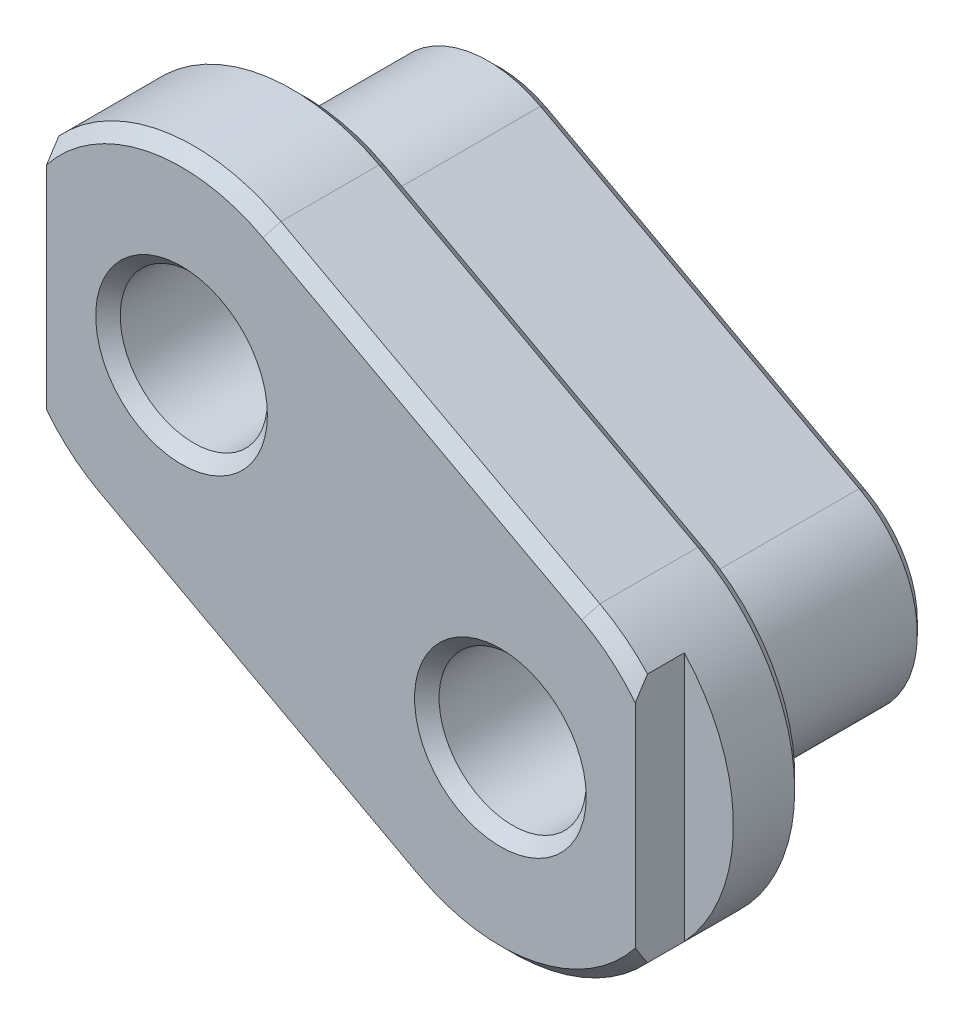
ISO-10303-21;
HEADER;
FILE_DESCRIPTION(('STEP AP214'),'2;1');
FILE_NAME('part.step','',(''),(''),'','','');
FILE_SCHEMA(('AUTOMOTIVE_DESIGN { 1 0 10303 214 1 1 1 1 }'));
ENDSEC;
DATA;
#1=APPLICATION_CONTEXT('core data for automotive mechanical design processes');
#2=APPLICATION_PROTOCOL_DEFINITION('international standard','automotive_design',2000,#1);
#3=PRODUCT_CONTEXT('',#1,'mechanical');
#4=PRODUCT('Part','Part','',(#3));
#5=PRODUCT_RELATED_PRODUCT_CATEGORY('part','',(#4));
#6=PRODUCT_DEFINITION_FORMATION('','',#4);
#7=PRODUCT_DEFINITION_CONTEXT('part definition',#1,'design');
#8=PRODUCT_DEFINITION('design','',#6,#7);
#9=PRODUCT_DEFINITION_SHAPE('','',#8);
#10=(LENGTH_UNIT() NAMED_UNIT(*) SI_UNIT(.MILLI.,.METRE.));
#11=(NAMED_UNIT(*) PLANE_ANGLE_UNIT() SI_UNIT($,.RADIAN.));
#12=(NAMED_UNIT(*) SI_UNIT($,.STERADIAN.) SOLID_ANGLE_UNIT());
#13=UNCERTAINTY_MEASURE_WITH_UNIT(LENGTH_MEASURE(1.E-05),#10,'distance_accuracy_value','');
#14=(GEOMETRIC_REPRESENTATION_CONTEXT(3) GLOBAL_UNCERTAINTY_ASSIGNED_CONTEXT((#13)) GLOBAL_UNIT_ASSIGNED_CONTEXT((#10,
#11,#12)) REPRESENTATION_CONTEXT('',''));
#15=CARTESIAN_POINT('',(0.,0.,0.));
#16=DIRECTION('',(0.,0.,1.));
#17=DIRECTION('',(1.,0.,0.));
#18=AXIS2_PLACEMENT_3D('',#15,#16,#17);
#19=CARTESIAN_POINT('',(0.,0.,16.));
#20=DIRECTION('',(0.,0.,-1.));
#21=DIRECTION('',(-1.,0.,0.));
#22=AXIS2_PLACEMENT_3D('',#19,#20,#21);
#23=CYLINDRICAL_SURFACE('',#22,8.99999999999999);
#24=DIRECTION('',(0.,0.,-1.));
#25=VECTOR('',#24,1.);
#26=CARTESIAN_POINT('',(-4.26689840731516,-7.92423989929957,16.));
#27=LINE('',#26,#25);
#28=CARTESIAN_POINT('',(-4.26689840731516,-7.92423989929957,16.));
#29=VERTEX_POINT('',#28);
#30=CARTESIAN_POINT('',(-4.26689840731516,-7.92423989929957,0.999999999999999));
#31=VERTEX_POINT('',#30);
#32=EDGE_CURVE('E237',#29,#31,#27,.T.);
#33=ORIENTED_EDGE('',*,*,#32,.T.);
#34=CARTESIAN_POINT('',(0.,0.,0.999999999999999));
#35=DIRECTION('',(0.,0.,1.));
#36=DIRECTION('',(1.,0.,0.));
#37=AXIS2_PLACEMENT_3D('',#34,#35,#36);
#38=CIRCLE('',#37,8.99999999999999);
#39=CARTESIAN_POINT('',(4.26689840731516,7.92423989929956,0.999999999999999));
#40=VERTEX_POINT('',#39);
#41=EDGE_CURVE('E271',#31,#40,#38,.T.);
#42=ORIENTED_EDGE('',*,*,#41,.T.);
#43=DIRECTION('',(0.,0.,-1.));
#44=VECTOR('',#43,1.);
#45=CARTESIAN_POINT('',(4.26689840731516,7.92423989929956,16.));
#46=LINE('',#45,#44);
#47=CARTESIAN_POINT('',(4.26689840731516,7.92423989929956,16.));
#48=VERTEX_POINT('',#47);
#49=EDGE_CURVE('E246',#48,#40,#46,.T.);
#50=ORIENTED_EDGE('',*,*,#49,.F.);
#51=CARTESIAN_POINT('',(0.,0.,16.));
#52=DIRECTION('',(0.,0.,1.));
#53=DIRECTION('',(1.,0.,0.));
#54=AXIS2_PLACEMENT_3D('',#51,#52,#53);
#55=CIRCLE('',#54,8.99999999999999);
#56=EDGE_CURVE('E225',#29,#48,#55,.T.);
#57=ORIENTED_EDGE('',*,*,#56,.F.);
#58=EDGE_LOOP('',(#33,#42,#50,#57));
#59=FACE_BOUND('',#58,.T.);
#60=ADVANCED_FACE('F34',(#59),#23,.T.);
#61=CARTESIAN_POINT('',(-21.7331015926848,21.9242398992996,16.));
#62=DIRECTION('',(-0.474099823035018,-0.880471099922175,0.));
#63=DIRECTION('',(0.880471099922175,-0.474099823035018,0.));
#64=AXIS2_PLACEMENT_3D('',#61,#62,#63);
#65=PLANE('',#64);
#66=ORIENTED_EDGE('',*,*,#49,.T.);
#67=DIRECTION('',(-0.880471099922175,0.474099823035018,0.));
#68=VECTOR('',#67,1.);
#69=CARTESIAN_POINT('',(-21.7331015926848,21.9242398992996,0.999999999999999));
#70=LINE('',#69,#68);
#71=CARTESIAN_POINT('',(-21.7331015926848,21.9242398992996,0.999999999999999));
#72=VERTEX_POINT('',#71);
#73=EDGE_CURVE('E249',#40,#72,#70,.T.);
#74=ORIENTED_EDGE('',*,*,#73,.T.);
#75=DIRECTION('',(0.,0.,-1.));
#76=VECTOR('',#75,1.);
#77=CARTESIAN_POINT('',(-21.7331015926848,21.9242398992996,16.));
#78=LINE('',#77,#76);
#79=CARTESIAN_POINT('',(-21.7331015926848,21.9242398992996,16.));
#80=VERTEX_POINT('',#79);
#81=EDGE_CURVE('E243',#80,#72,#78,.T.);
#82=ORIENTED_EDGE('',*,*,#81,.F.);
#83=DIRECTION('',(-0.880471099922175,0.474099823035018,0.));
#84=VECTOR('',#83,1.);
#85=CARTESIAN_POINT('',(-21.7331015926848,21.9242398992996,16.));
#86=LINE('',#85,#84);
#87=EDGE_CURVE('E228',#48,#80,#86,.T.);
#88=ORIENTED_EDGE('',*,*,#87,.F.);
#89=EDGE_LOOP('',(#66,#74,#82,#88));
#90=FACE_BOUND('',#89,.T.);
#91=ADVANCED_FACE('F398',(#90),#65,.F.);
#92=CARTESIAN_POINT('',(-26.,14.,16.));
#93=DIRECTION('',(0.,0.,-1.));
#94=DIRECTION('',(-1.,0.,0.));
#95=AXIS2_PLACEMENT_3D('',#92,#93,#94);
#96=CYLINDRICAL_SURFACE('',#95,9.);
#97=ORIENTED_EDGE('',*,*,#81,.T.);
#98=CARTESIAN_POINT('',(-26.,14.,0.999999999999999));
#99=DIRECTION('',(0.,0.,1.));
#100=DIRECTION('',(1.,0.,0.));
#101=AXIS2_PLACEMENT_3D('',#98,#99,#100);
#102=CIRCLE('',#101,9.);
#103=CARTESIAN_POINT('',(-30.2668984073152,6.07576010070043,0.999999999999999));
#104=VERTEX_POINT('',#103);
#105=EDGE_CURVE('E267',#72,#104,#102,.T.);
#106=ORIENTED_EDGE('',*,*,#105,.T.);
#107=DIRECTION('',(0.,0.,-1.));
#108=VECTOR('',#107,1.);
#109=CARTESIAN_POINT('',(-30.2668984073152,6.07576010070043,16.));
#110=LINE('',#109,#108);
#111=CARTESIAN_POINT('',(-30.2668984073152,6.07576010070043,16.));
#112=VERTEX_POINT('',#111);
#113=EDGE_CURVE('E240',#112,#104,#110,.T.);
#114=ORIENTED_EDGE('',*,*,#113,.F.);
#115=CARTESIAN_POINT('',(-26.,14.,16.));
#116=DIRECTION('',(0.,0.,1.));
#117=DIRECTION('',(1.,0.,0.));
#118=AXIS2_PLACEMENT_3D('',#115,#116,#117);
#119=CIRCLE('',#118,9.);
#120=EDGE_CURVE('E231',#80,#112,#119,.T.);
#121=ORIENTED_EDGE('',*,*,#120,.F.);
#122=EDGE_LOOP('',(#97,#106,#114,#121));
#123=FACE_BOUND('',#122,.T.);
#124=ADVANCED_FACE('F404',(#123),#96,.T.);
#125=CARTESIAN_POINT('',(-30.2668984073152,6.07576010070042,16.));
#126=DIRECTION('',(0.474099823035017,0.880471099922175,0.));
#127=DIRECTION('',(-0.880471099922175,0.474099823035018,0.));
#128=AXIS2_PLACEMENT_3D('',#125,#126,#127);
#129=PLANE('',#128);
#130=ORIENTED_EDGE('',*,*,#113,.T.);
#131=DIRECTION('',(0.880471099922175,-0.474099823035018,0.));
#132=VECTOR('',#131,1.);
#133=CARTESIAN_POINT('',(-30.2668984073152,6.07576010070042,0.999999999999999));
#134=LINE('',#133,#132);
#135=EDGE_CURVE('E269',#104,#31,#134,.T.);
#136=ORIENTED_EDGE('',*,*,#135,.T.);
#137=ORIENTED_EDGE('',*,*,#32,.F.);
#138=DIRECTION('',(0.880471099922175,-0.474099823035017,0.));
#139=VECTOR('',#138,1.);
#140=CARTESIAN_POINT('',(-30.2668984073152,6.07576010070042,16.));
#141=LINE('',#140,#139);
#142=EDGE_CURVE('E234',#112,#29,#141,.T.);
#143=ORIENTED_EDGE('',*,*,#142,.F.);
#144=EDGE_LOOP('',(#130,#136,#137,#143));
#145=FACE_BOUND('',#144,.T.);
#146=ADVANCED_FACE('F540',(#145),#129,.F.);
#147=CARTESIAN_POINT('',(0.,0.,0.));
#148=DIRECTION('',(0.,0.,1.));
#149=DIRECTION('',(1.,0.,0.));
#150=AXIS2_PLACEMENT_3D('',#147,#148,#149);
#151=PLANE('',#150);
#152=CARTESIAN_POINT('',(-26.,14.,0.));
#153=DIRECTION('',(0.,0.,1.));
#154=DIRECTION('',(1.,0.,0.));
#155=AXIS2_PLACEMENT_3D('',#152,#153,#154);
#156=CIRCLE('',#155,7.99999999999999);
#157=CARTESIAN_POINT('',(-29.7927985842801,6.95623120062261,0.));
#158=VERTEX_POINT('',#157);
#159=CARTESIAN_POINT('',(-22.2072014157199,21.0437687993774,0.));
#160=VERTEX_POINT('',#159);
#161=EDGE_CURVE('E262',#158,#160,#156,.F.);
#162=ORIENTED_EDGE('',*,*,#161,.T.);
#163=DIRECTION('',(0.880471099922175,-0.474099823035018,0.));
#164=VECTOR('',#163,1.);
#165=CARTESIAN_POINT('',(3.79279858428014,7.04376879937739,0.));
#166=LINE('',#165,#164);
#167=CARTESIAN_POINT('',(3.79279858428014,7.04376879937739,0.));
#168=VERTEX_POINT('',#167);
#169=EDGE_CURVE('E264',#160,#168,#166,.T.);
#170=ORIENTED_EDGE('',*,*,#169,.T.);
#171=CARTESIAN_POINT('',(0.,0.,0.));
#172=DIRECTION('',(0.,0.,1.));
#173=DIRECTION('',(1.,0.,0.));
#174=AXIS2_PLACEMENT_3D('',#171,#172,#173);
#175=CIRCLE('',#174,7.99999999999999);
#176=CARTESIAN_POINT('',(-3.79279858428014,-7.04376879937739,0.));
#177=VERTEX_POINT('',#176);
#178=EDGE_CURVE('E258',#168,#177,#175,.F.);
#179=ORIENTED_EDGE('',*,*,#178,.T.);
#180=DIRECTION('',(-0.880471099922175,0.474099823035018,0.));
#181=VECTOR('',#180,1.);
#182=CARTESIAN_POINT('',(-3.79279858428013,-7.04376879937739,0.));
#183=LINE('',#182,#181);
#184=EDGE_CURVE('E260',#177,#158,#183,.T.);
#185=ORIENTED_EDGE('',*,*,#184,.T.);
#186=EDGE_LOOP('',(#162,#170,#179,#185));
#187=FACE_BOUND('',#186,.T.);
#188=CARTESIAN_POINT('',(-26.,14.,0.));
#189=DIRECTION('',(0.,0.,1.));
#190=DIRECTION('',(1.,0.,0.));
#191=AXIS2_PLACEMENT_3D('',#188,#189,#190);
#192=CIRCLE('',#191,7.00000000000001);
#193=CARTESIAN_POINT('',(-19.,14.,0.));
#194=VERTEX_POINT('',#193);
#195=EDGE_CURVE('E255',#194,#194,#192,.T.);
#196=ORIENTED_EDGE('',*,*,#195,.T.);
#197=EDGE_LOOP('',(#196));
#198=FACE_BOUND('',#197,.T.);
#199=CARTESIAN_POINT('',(0.,0.,0.));
#200=DIRECTION('',(0.,0.,1.));
#201=DIRECTION('',(1.,0.,0.));
#202=AXIS2_PLACEMENT_3D('',#199,#200,#201);
#203=CIRCLE('',#202,7.00000000000001);
#204=CARTESIAN_POINT('',(7.00000000000001,0.,0.));
#205=VERTEX_POINT('',#204);
#206=EDGE_CURVE('E252',#205,#205,#203,.T.);
#207=ORIENTED_EDGE('',*,*,#206,.T.);
#208=EDGE_LOOP('',(#207));
#209=FACE_BOUND('',#208,.T.);
#210=ADVANCED_FACE('F530',(#187,#198,#209),#151,.F.);
#211=CARTESIAN_POINT('',(0.,0.,16.));
#212=DIRECTION('',(0.,0.,1.));
#213=DIRECTION('',(1.,0.,0.));
#214=AXIS2_PLACEMENT_3D('',#211,#212,#213);
#215=PLANE('',#214);
#216=DIRECTION('',(0.880471099922175,-0.474099823035018,0.));
#217=VECTOR('',#216,1.);
#218=CARTESIAN_POINT('',(6.63739752249025,12.3265953989105,16.));
#219=LINE('',#218,#217);
#220=CARTESIAN_POINT('',(-19.3626024775097,26.3265953989105,16.));
#221=VERTEX_POINT('',#220);
#222=CARTESIAN_POINT('',(6.63739752249026,12.3265953989104,16.));
#223=VERTEX_POINT('',#222);
#224=EDGE_CURVE('E296',#221,#223,#219,.T.);
#225=ORIENTED_EDGE('',*,*,#224,.T.);
#226=CARTESIAN_POINT('',(0.,0.,16.));
#227=DIRECTION('',(0.,0.,1.));
#228=DIRECTION('',(1.,0.,0.));
#229=AXIS2_PLACEMENT_3D('',#226,#227,#228);
#230=CIRCLE('',#229,14.);
#231=CARTESIAN_POINT('',(-6.63739752249026,-12.3265953989105,16.));
#232=VERTEX_POINT('',#231);
#233=EDGE_CURVE('E298',#223,#232,#230,.F.);
#234=ORIENTED_EDGE('',*,*,#233,.T.);
#235=DIRECTION('',(-0.880471099922175,0.474099823035018,0.));
#236=VECTOR('',#235,1.);
#237=CARTESIAN_POINT('',(-6.63739752249025,-12.3265953989105,16.));
#238=LINE('',#237,#236);
#239=CARTESIAN_POINT('',(-32.6373975224902,1.67340460108955,16.));
#240=VERTEX_POINT('',#239);
#241=EDGE_CURVE('E294',#232,#240,#238,.T.);
#242=ORIENTED_EDGE('',*,*,#241,.T.);
#243=CARTESIAN_POINT('',(-26.,14.,16.));
#244=DIRECTION('',(0.,0.,1.));
#245=DIRECTION('',(1.,0.,0.));
#246=AXIS2_PLACEMENT_3D('',#243,#244,#245);
#247=CIRCLE('',#246,14.);
#248=EDGE_CURVE('E292',#240,#221,#247,.F.);
#249=ORIENTED_EDGE('',*,*,#248,.T.);
#250=EDGE_LOOP('',(#225,#234,#242,#249));
#251=FACE_BOUND('',#250,.T.);
#252=ORIENTED_EDGE('',*,*,#142,.T.);
#253=ORIENTED_EDGE('',*,*,#56,.T.);
#254=ORIENTED_EDGE('',*,*,#87,.T.);
#255=ORIENTED_EDGE('',*,*,#120,.T.);
#256=EDGE_LOOP('',(#252,#253,#254,#255));
#257=FACE_BOUND('',#256,.T.);
#258=ADVANCED_FACE('F537',(#251,#257),#215,.F.);
#259=CARTESIAN_POINT('',(0.,0.,26.));
#260=DIRECTION('',(0.,0.,-1.));
#261=DIRECTION('',(-1.,0.,0.));
#262=AXIS2_PLACEMENT_3D('',#259,#260,#261);
#263=CYLINDRICAL_SURFACE('',#262,15.);
#264=DIRECTION('',(0.,0.,-1.));
#265=VECTOR('',#264,1.);
#266=CARTESIAN_POINT('',(-7.11149734552527,-13.2070664988326,26.));
#267=LINE('',#266,#265);
#268=CARTESIAN_POINT('',(-7.11149734552527,-13.2070664988326,25.));
#269=VERTEX_POINT('',#268);
#270=CARTESIAN_POINT('',(-7.11149734552527,-13.2070664988326,17.));
#271=VERTEX_POINT('',#270);
#272=EDGE_CURVE('E196',#269,#271,#267,.T.);
#273=ORIENTED_EDGE('',*,*,#272,.T.);
#274=CARTESIAN_POINT('',(0.,0.,17.));
#275=DIRECTION('',(0.,0.,1.));
#276=DIRECTION('',(1.,0.,0.));
#277=AXIS2_PLACEMENT_3D('',#274,#275,#276);
#278=CIRCLE('',#277,15.);
#279=CARTESIAN_POINT('',(7.11149734552527,13.2070664988326,17.));
#280=VERTEX_POINT('',#279);
#281=EDGE_CURVE('E289',#271,#280,#278,.T.);
#282=ORIENTED_EDGE('',*,*,#281,.T.);
#283=DIRECTION('',(0.,0.,-1.));
#284=VECTOR('',#283,1.);
#285=CARTESIAN_POINT('',(7.11149734552527,13.2070664988326,26.));
#286=LINE('',#285,#284);
#287=CARTESIAN_POINT('',(7.11149734552527,13.2070664988326,25.));
#288=VERTEX_POINT('',#287);
#289=EDGE_CURVE('E222',#288,#280,#286,.T.);
#290=ORIENTED_EDGE('',*,*,#289,.F.);
#291=CARTESIAN_POINT('',(0.,0.,25.));
#292=DIRECTION('',(0.,0.,1.));
#293=DIRECTION('',(1.,0.,0.));
#294=AXIS2_PLACEMENT_3D('',#291,#292,#293);
#295=CIRCLE('',#294,15.);
#296=CARTESIAN_POINT('',(11.,10.1980390271856,25.));
#297=VERTEX_POINT('',#296);
#298=EDGE_CURVE('E285',#288,#297,#295,.F.);
#299=ORIENTED_EDGE('',*,*,#298,.T.);
#300=DIRECTION('',(0.,0.,1.));
#301=VECTOR('',#300,1.);
#302=CARTESIAN_POINT('',(11.,10.1980390271856,22.));
#303=LINE('',#302,#301);
#304=CARTESIAN_POINT('',(11.,10.1980390271856,22.));
#305=VERTEX_POINT('',#304);
#306=EDGE_CURVE('E206',#305,#297,#303,.T.);
#307=ORIENTED_EDGE('',*,*,#306,.F.);
#308=CARTESIAN_POINT('',(0.,0.,22.));
#309=DIRECTION('',(0.,0.,1.));
#310=DIRECTION('',(1.,0.,0.));
#311=AXIS2_PLACEMENT_3D('',#308,#309,#310);
#312=CIRCLE('',#311,15.);
#313=CARTESIAN_POINT('',(11.,-10.1980390271856,22.));
#314=VERTEX_POINT('',#313);
#315=EDGE_CURVE('E200',#314,#305,#312,.T.);
#316=ORIENTED_EDGE('',*,*,#315,.F.);
#317=DIRECTION('',(0.,0.,1.));
#318=VECTOR('',#317,1.);
#319=CARTESIAN_POINT('',(11.,-10.1980390271856,22.));
#320=LINE('',#319,#318);
#321=CARTESIAN_POINT('',(11.,-10.1980390271856,25.));
#322=VERTEX_POINT('',#321);
#323=EDGE_CURVE('E210',#314,#322,#320,.T.);
#324=ORIENTED_EDGE('',*,*,#323,.T.);
#325=CARTESIAN_POINT('',(0.,0.,25.));
#326=DIRECTION('',(0.,0.,1.));
#327=DIRECTION('',(1.,0.,0.));
#328=AXIS2_PLACEMENT_3D('',#325,#326,#327);
#329=CIRCLE('',#328,15.);
#330=EDGE_CURVE('E287',#322,#269,#329,.F.);
#331=ORIENTED_EDGE('',*,*,#330,.T.);
#332=EDGE_LOOP('',(#273,#282,#290,#299,#307,#316,#324,#331));
#333=FACE_BOUND('',#332,.T.);
#334=ADVANCED_FACE('F493',(#333),#263,.T.);
#335=CARTESIAN_POINT('',(7.11149734552527,13.2070664988326,26.));
#336=DIRECTION('',(-0.474099823035018,-0.880471099922175,0.));
#337=DIRECTION('',(0.880471099922175,-0.474099823035018,0.));
#338=AXIS2_PLACEMENT_3D('',#335,#336,#337);
#339=PLANE('',#338);
#340=ORIENTED_EDGE('',*,*,#289,.T.);
#341=DIRECTION('',(-0.880471099922175,0.474099823035018,0.));
#342=VECTOR('',#341,1.);
#343=CARTESIAN_POINT('',(7.11149734552527,13.2070664988326,17.));
#344=LINE('',#343,#342);
#345=CARTESIAN_POINT('',(-18.8885026544747,27.2070664988326,17.));
#346=VERTEX_POINT('',#345);
#347=EDGE_CURVE('E303',#280,#346,#344,.T.);
#348=ORIENTED_EDGE('',*,*,#347,.T.);
#349=DIRECTION('',(0.,0.,-1.));
#350=VECTOR('',#349,1.);
#351=CARTESIAN_POINT('',(-18.8885026544747,27.2070664988326,26.));
#352=LINE('',#351,#350);
#353=CARTESIAN_POINT('',(-18.8885026544747,27.2070664988326,25.));
#354=VERTEX_POINT('',#353);
#355=EDGE_CURVE('E220',#354,#346,#352,.T.);
#356=ORIENTED_EDGE('',*,*,#355,.F.);
#357=DIRECTION('',(0.880471099922175,-0.474099823035018,0.));
#358=VECTOR('',#357,1.);
#359=CARTESIAN_POINT('',(7.11149734552528,13.2070664988326,25.));
#360=LINE('',#359,#358);
#361=EDGE_CURVE('E301',#354,#288,#360,.T.);
#362=ORIENTED_EDGE('',*,*,#361,.T.);
#363=EDGE_LOOP('',(#340,#348,#356,#362));
#364=FACE_BOUND('',#363,.T.);
#365=ADVANCED_FACE('F482',(#364),#339,.F.);
#366=CARTESIAN_POINT('',(-26.,14.,26.));
#367=DIRECTION('',(0.,0.,-1.));
#368=DIRECTION('',(-1.,0.,0.));
#369=AXIS2_PLACEMENT_3D('',#366,#367,#368);
#370=CYLINDRICAL_SURFACE('',#369,15.);
#371=ORIENTED_EDGE('',*,*,#355,.T.);
#372=CARTESIAN_POINT('',(-26.,14.,17.));
#373=DIRECTION('',(0.,0.,1.));
#374=DIRECTION('',(1.,0.,0.));
#375=AXIS2_PLACEMENT_3D('',#372,#373,#374);
#376=CIRCLE('',#375,15.);
#377=CARTESIAN_POINT('',(-33.1114973455253,0.792933501167378,17.));
#378=VERTEX_POINT('',#377);
#379=EDGE_CURVE('E312',#346,#378,#376,.T.);
#380=ORIENTED_EDGE('',*,*,#379,.T.);
#381=DIRECTION('',(0.,0.,-1.));
#382=VECTOR('',#381,1.);
#383=CARTESIAN_POINT('',(-33.1114973455253,0.792933501167378,26.));
#384=LINE('',#383,#382);
#385=CARTESIAN_POINT('',(-33.1114973455253,0.792933501167378,25.));
#386=VERTEX_POINT('',#385);
#387=EDGE_CURVE('E217',#386,#378,#384,.T.);
#388=ORIENTED_EDGE('',*,*,#387,.F.);
#389=CARTESIAN_POINT('',(-26.,14.,25.));
#390=DIRECTION('',(0.,0.,1.));
#391=DIRECTION('',(1.,0.,0.));
#392=AXIS2_PLACEMENT_3D('',#389,#390,#391);
#393=CIRCLE('',#392,15.);
#394=CARTESIAN_POINT('',(-37.,3.80196097281443,25.));
#395=VERTEX_POINT('',#394);
#396=EDGE_CURVE('E194',#386,#395,#393,.F.);
#397=ORIENTED_EDGE('',*,*,#396,.T.);
#398=DIRECTION('',(0.,0.,1.));
#399=VECTOR('',#398,1.);
#400=CARTESIAN_POINT('',(-37.,3.80196097281443,22.));
#401=LINE('',#400,#399);
#402=CARTESIAN_POINT('',(-37.,3.80196097281443,22.));
#403=VERTEX_POINT('',#402);
#404=EDGE_CURVE('E187',#403,#395,#401,.T.);
#405=ORIENTED_EDGE('',*,*,#404,.F.);
#406=CARTESIAN_POINT('',(-26.,14.,22.));
#407=DIRECTION('',(0.,0.,1.));
#408=DIRECTION('',(1.,0.,0.));
#409=AXIS2_PLACEMENT_3D('',#406,#407,#408);
#410=CIRCLE('',#409,15.);
#411=CARTESIAN_POINT('',(-37.,24.1980390271856,22.));
#412=VERTEX_POINT('',#411);
#413=EDGE_CURVE('E175',#412,#403,#410,.T.);
#414=ORIENTED_EDGE('',*,*,#413,.F.);
#415=DIRECTION('',(0.,0.,1.));
#416=VECTOR('',#415,1.);
#417=CARTESIAN_POINT('',(-37.,24.1980390271856,22.));
#418=LINE('',#417,#416);
#419=CARTESIAN_POINT('',(-37.,24.1980390271856,25.));
#420=VERTEX_POINT('',#419);
#421=EDGE_CURVE('E189',#412,#420,#418,.T.);
#422=ORIENTED_EDGE('',*,*,#421,.T.);
#423=CARTESIAN_POINT('',(-26.,14.,25.));
#424=DIRECTION('',(0.,0.,1.));
#425=DIRECTION('',(1.,0.,0.));
#426=AXIS2_PLACEMENT_3D('',#423,#424,#425);
#427=CIRCLE('',#426,15.);
#428=EDGE_CURVE('E309',#420,#354,#427,.F.);
#429=ORIENTED_EDGE('',*,*,#428,.T.);
#430=EDGE_LOOP('',(#371,#380,#388,#397,#405,#414,#422,#429));
#431=FACE_BOUND('',#430,.T.);
#432=ADVANCED_FACE('F192',(#431),#370,.T.);
#433=CARTESIAN_POINT('',(-33.1114973455253,0.792933501167378,26.));
#434=DIRECTION('',(0.474099823035018,0.880471099922175,0.));
#435=DIRECTION('',(-0.880471099922175,0.474099823035018,0.));
#436=AXIS2_PLACEMENT_3D('',#433,#434,#435);
#437=PLANE('',#436);
#438=ORIENTED_EDGE('',*,*,#387,.T.);
#439=DIRECTION('',(0.880471099922175,-0.474099823035018,0.));
#440=VECTOR('',#439,1.);
#441=CARTESIAN_POINT('',(-33.1114973455253,0.792933501167378,17.));
#442=LINE('',#441,#440);
#443=EDGE_CURVE('E307',#378,#271,#442,.T.);
#444=ORIENTED_EDGE('',*,*,#443,.T.);
#445=ORIENTED_EDGE('',*,*,#272,.F.);
#446=DIRECTION('',(-0.880471099922175,0.474099823035018,0.));
#447=VECTOR('',#446,1.);
#448=CARTESIAN_POINT('',(-33.1114973455253,0.792933501167377,25.));
#449=LINE('',#448,#447);
#450=EDGE_CURVE('E305',#269,#386,#449,.T.);
#451=ORIENTED_EDGE('',*,*,#450,.T.);
#452=EDGE_LOOP('',(#438,#444,#445,#451));
#453=FACE_BOUND('',#452,.T.);
#454=ADVANCED_FACE('F555',(#453),#437,.F.);
#455=CARTESIAN_POINT('',(0.,0.,26.));
#456=DIRECTION('',(0.,0.,1.));
#457=DIRECTION('',(1.,0.,0.));
#458=AXIS2_PLACEMENT_3D('',#455,#456,#457);
#459=PLANE('',#458);
#460=CARTESIAN_POINT('',(-26.,14.,26.));
#461=DIRECTION('',(0.,0.,1.));
#462=DIRECTION('',(1.,0.,0.));
#463=AXIS2_PLACEMENT_3D('',#460,#461,#462);
#464=CIRCLE('',#463,7.);
#465=CARTESIAN_POINT('',(-19.,14.,26.));
#466=VERTEX_POINT('',#465);
#467=EDGE_CURVE('E329',#466,#466,#464,.F.);
#468=ORIENTED_EDGE('',*,*,#467,.T.);
#469=EDGE_LOOP('',(#468));
#470=FACE_BOUND('',#469,.T.);
#471=CARTESIAN_POINT('',(0.,0.,26.));
#472=DIRECTION('',(0.,0.,1.));
#473=DIRECTION('',(1.,0.,0.));
#474=AXIS2_PLACEMENT_3D('',#471,#472,#473);
#475=CIRCLE('',#474,7.);
#476=CARTESIAN_POINT('',(7.,0.,26.));
#477=VERTEX_POINT('',#476);
#478=EDGE_CURVE('E326',#477,#477,#475,.F.);
#479=ORIENTED_EDGE('',*,*,#478,.T.);
#480=EDGE_LOOP('',(#479));
#481=FACE_BOUND('',#480,.T.);
#482=DIRECTION('',(0.,1.,0.));
#483=VECTOR('',#482,1.);
#484=CARTESIAN_POINT('',(-37.,24.1980390271856,26.));
#485=LINE('',#484,#483);
#486=CARTESIAN_POINT('',(-37.,5.33974596215563,26.));
#487=VERTEX_POINT('',#486);
#488=CARTESIAN_POINT('',(-37.,22.6602540378444,26.));
#489=VERTEX_POINT('',#488);
#490=EDGE_CURVE('E182',#487,#489,#485,.T.);
#491=ORIENTED_EDGE('',*,*,#490,.F.);
#492=CARTESIAN_POINT('',(-26.,14.,26.));
#493=DIRECTION('',(0.,0.,1.));
#494=DIRECTION('',(1.,0.,0.));
#495=AXIS2_PLACEMENT_3D('',#492,#493,#494);
#496=CIRCLE('',#495,14.);
#497=CARTESIAN_POINT('',(-32.6373975224902,1.67340460108956,26.));
#498=VERTEX_POINT('',#497);
#499=EDGE_CURVE('E324',#487,#498,#496,.T.);
#500=ORIENTED_EDGE('',*,*,#499,.T.);
#501=DIRECTION('',(0.880471099922175,-0.474099823035018,0.));
#502=VECTOR('',#501,1.);
#503=CARTESIAN_POINT('',(-6.63739752249025,-12.3265953989104,26.));
#504=LINE('',#503,#502);
#505=CARTESIAN_POINT('',(-6.63739752249025,-12.3265953989104,26.));
#506=VERTEX_POINT('',#505);
#507=EDGE_CURVE('E59',#498,#506,#504,.T.);
#508=ORIENTED_EDGE('',*,*,#507,.T.);
#509=CARTESIAN_POINT('',(0.,0.,26.));
#510=DIRECTION('',(0.,0.,1.));
#511=DIRECTION('',(1.,0.,0.));
#512=AXIS2_PLACEMENT_3D('',#509,#510,#511);
#513=CIRCLE('',#512,14.);
#514=CARTESIAN_POINT('',(11.,-8.66025403784437,26.));
#515=VERTEX_POINT('',#514);
#516=EDGE_CURVE('E321',#506,#515,#513,.T.);
#517=ORIENTED_EDGE('',*,*,#516,.T.);
#518=DIRECTION('',(0.,-1.,0.));
#519=VECTOR('',#518,1.);
#520=CARTESIAN_POINT('',(11.,10.1980390271856,26.));
#521=LINE('',#520,#519);
#522=CARTESIAN_POINT('',(11.,8.66025403784437,26.));
#523=VERTEX_POINT('',#522);
#524=EDGE_CURVE('E203',#523,#515,#521,.T.);
#525=ORIENTED_EDGE('',*,*,#524,.F.);
#526=CARTESIAN_POINT('',(0.,0.,26.));
#527=DIRECTION('',(0.,0.,1.));
#528=DIRECTION('',(1.,0.,0.));
#529=AXIS2_PLACEMENT_3D('',#526,#527,#528);
#530=CIRCLE('',#529,14.);
#531=CARTESIAN_POINT('',(6.63739752249025,12.3265953989104,26.));
#532=VERTEX_POINT('',#531);
#533=EDGE_CURVE('E318',#523,#532,#530,.T.);
#534=ORIENTED_EDGE('',*,*,#533,.T.);
#535=DIRECTION('',(-0.880471099922175,0.474099823035018,0.));
#536=VECTOR('',#535,1.);
#537=CARTESIAN_POINT('',(-19.3626024775098,26.3265953989104,26.));
#538=LINE('',#537,#536);
#539=CARTESIAN_POINT('',(-19.3626024775098,26.3265953989104,26.));
#540=VERTEX_POINT('',#539);
#541=EDGE_CURVE('E316',#532,#540,#538,.T.);
#542=ORIENTED_EDGE('',*,*,#541,.T.);
#543=CARTESIAN_POINT('',(-26.,14.,26.));
#544=DIRECTION('',(0.,0.,1.));
#545=DIRECTION('',(1.,0.,0.));
#546=AXIS2_PLACEMENT_3D('',#543,#544,#545);
#547=CIRCLE('',#546,14.);
#548=EDGE_CURVE('E314',#540,#489,#547,.T.);
#549=ORIENTED_EDGE('',*,*,#548,.T.);
#550=EDGE_LOOP('',(#491,#500,#508,#517,#525,#534,#542,#549));
#551=FACE_BOUND('',#550,.T.);
#552=ADVANCED_FACE('F360',(#470,#481,#551),#459,.T.);
#553=CARTESIAN_POINT('',(11.,10.1980390271856,22.));
#554=DIRECTION('',(-1.,0.,0.));
#555=DIRECTION('',(0.,-1.,0.));
#556=AXIS2_PLACEMENT_3D('',#553,#554,#555);
#557=PLANE('',#556);
#558=ORIENTED_EDGE('',*,*,#524,.T.);
#559=CARTESIAN_POINT('',(11.,-8.66025403784437,26.));
#560=CARTESIAN_POINT('',(11.,-8.79027144318521,25.9195703536757));
#561=CARTESIAN_POINT('',(11.,-8.91978924484243,25.8383361007494));
#562=CARTESIAN_POINT('',(11.,-9.17786283805276,25.6743858458112));
#563=CARTESIAN_POINT('',(11.,-9.30641873923803,25.591670016424));
#564=CARTESIAN_POINT('',(11.,-9.56263424634968,25.4248664125517));
#565=CARTESIAN_POINT('',(11.,-9.69029386318121,25.3407786548004));
#566=CARTESIAN_POINT('',(11.,-9.94478168559513,25.1713222713733));
#567=CARTESIAN_POINT('',(11.,-10.0716097932226,25.0859534985509));
#568=CARTESIAN_POINT('',(11.,-10.1980390271856,25.));
#569=B_SPLINE_CURVE_WITH_KNOTS('',3,(#559,#560,#561,#562,#563,#564,#565,#566,#567,#568),
.UNSPECIFIED.,.F.,.F.,(4,2,2,2,4),(0.,0.458646153912249,0.917239212259313,1.37582668116352,
1.83446723618275),.UNSPECIFIED.);
#570=EDGE_CURVE('E11',#515,#322,#569,.T.);
#571=ORIENTED_EDGE('',*,*,#570,.T.);
#572=ORIENTED_EDGE('',*,*,#323,.F.);
#573=DIRECTION('',(0.,-1.,0.));
#574=VECTOR('',#573,1.);
#575=CARTESIAN_POINT('',(11.,10.1980390271856,22.));
#576=LINE('',#575,#574);
#577=EDGE_CURVE('E202',#305,#314,#576,.T.);
#578=ORIENTED_EDGE('',*,*,#577,.F.);
#579=ORIENTED_EDGE('',*,*,#306,.T.);
#580=CARTESIAN_POINT('',(11.,10.1980390271856,25.));
#581=CARTESIAN_POINT('',(11.,10.0716097932226,25.0859534985509));
#582=CARTESIAN_POINT('',(11.,9.94478168559514,25.1713222713732));
#583=CARTESIAN_POINT('',(11.,9.69029386318122,25.3407786548004));
#584=CARTESIAN_POINT('',(11.,9.56263424634968,25.4248664125517));
#585=CARTESIAN_POINT('',(11.,9.30641873923803,25.591670016424));
#586=CARTESIAN_POINT('',(11.,9.17786283805276,25.6743858458112));
#587=CARTESIAN_POINT('',(11.,8.91978924484243,25.8383361007494));
#588=CARTESIAN_POINT('',(11.,8.79027144318521,25.9195703536757));
#589=CARTESIAN_POINT('',(11.,8.66025403784437,26.));
#590=B_SPLINE_CURVE_WITH_KNOTS('',3,(#580,#581,#582,#583,#584,#585,#586,#587,#588,#589),
.UNSPECIFIED.,.F.,.F.,(4,2,2,2,4),(0.,0.45864055501924,0.917228023923448,1.37582108227052,
1.83446723618277),.UNSPECIFIED.);
#591=EDGE_CURVE('E44',#297,#523,#590,.T.);
#592=ORIENTED_EDGE('',*,*,#591,.T.);
#593=EDGE_LOOP('',(#558,#571,#572,#578,#579,#592));
#594=FACE_BOUND('',#593,.T.);
#595=ADVANCED_FACE('F355',(#594),#557,.F.);
#596=CARTESIAN_POINT('',(0.,0.,22.));
#597=DIRECTION('',(0.,0.,1.));
#598=DIRECTION('',(1.,0.,0.));
#599=AXIS2_PLACEMENT_3D('',#596,#597,#598);
#600=PLANE('',#599);
#601=ORIENTED_EDGE('',*,*,#315,.T.);
#602=ORIENTED_EDGE('',*,*,#577,.T.);
#603=EDGE_LOOP('',(#601,#602));
#604=FACE_BOUND('',#603,.T.);
#605=ADVANCED_FACE('F350',(#604),#600,.T.);
#606=CARTESIAN_POINT('',(-37.,24.1980390271856,22.));
#607=DIRECTION('',(1.,0.,0.));
#608=DIRECTION('',(0.,1.,0.));
#609=AXIS2_PLACEMENT_3D('',#606,#607,#608);
#610=PLANE('',#609);
#611=ORIENTED_EDGE('',*,*,#404,.T.);
#612=CARTESIAN_POINT('',(-37.,3.80196097281443,25.));
#613=CARTESIAN_POINT('',(-37.,3.92839020677739,25.0859534985509));
#614=CARTESIAN_POINT('',(-37.,4.05521831440486,25.1713222713733));
#615=CARTESIAN_POINT('',(-37.,4.30970613681878,25.3407786548004));
#616=CARTESIAN_POINT('',(-37.,4.43736575365031,25.4248664125517));
#617=CARTESIAN_POINT('',(-37.,4.69358126076196,25.591670016424));
#618=CARTESIAN_POINT('',(-37.,4.82213716194723,25.6743858458112));
#619=CARTESIAN_POINT('',(-37.,5.08021075515756,25.8383361007494));
#620=CARTESIAN_POINT('',(-37.,5.20972855681478,25.9195703536757));
#621=CARTESIAN_POINT('',(-37.,5.33974596215562,26.));
#622=B_SPLINE_CURVE_WITH_KNOTS('',3,(#612,#613,#614,#615,#616,#617,#618,#619,#620,#621),
.UNSPECIFIED.,.F.,.F.,(4,2,2,2,4),(0.,0.458640555019231,0.917228023923435,1.3758210822705,
1.83446723618275),.UNSPECIFIED.);
#623=EDGE_CURVE('E339',#395,#487,#622,.T.);
#624=ORIENTED_EDGE('',*,*,#623,.T.);
#625=ORIENTED_EDGE('',*,*,#490,.T.);
#626=CARTESIAN_POINT('',(-37.,22.6602540378444,26.));
#627=CARTESIAN_POINT('',(-37.,22.7902714431852,25.9195703536757));
#628=CARTESIAN_POINT('',(-37.,22.9197892448424,25.8383361007494));
#629=CARTESIAN_POINT('',(-37.,23.1778628380528,25.6743858458112));
#630=CARTESIAN_POINT('',(-37.,23.3064187392381,25.591670016424));
#631=CARTESIAN_POINT('',(-37.,23.5626342463497,25.4248664125517));
#632=CARTESIAN_POINT('',(-37.,23.6902938631812,25.3407786548004));
#633=CARTESIAN_POINT('',(-37.,23.9447816855952,25.1713222713732));
#634=CARTESIAN_POINT('',(-37.,24.0716097932226,25.0859534985509));
#635=CARTESIAN_POINT('',(-37.,24.1980390271856,25.));
#636=B_SPLINE_CURVE_WITH_KNOTS('',3,(#626,#627,#628,#629,#630,#631,#632,#633,#634,#635),
.UNSPECIFIED.,.F.,.F.,(4,2,2,2,4),(0.,0.458646153912252,0.917239212259322,1.37582668116353,
1.83446723618277),.UNSPECIFIED.);
#637=EDGE_CURVE('E332',#489,#420,#636,.T.);
#638=ORIENTED_EDGE('',*,*,#637,.T.);
#639=ORIENTED_EDGE('',*,*,#421,.F.);
#640=DIRECTION('',(0.,1.,0.));
#641=VECTOR('',#640,1.);
#642=CARTESIAN_POINT('',(-37.,24.1980390271856,22.));
#643=LINE('',#642,#641);
#644=EDGE_CURVE('E178',#403,#412,#643,.T.);
#645=ORIENTED_EDGE('',*,*,#644,.F.);
#646=EDGE_LOOP('',(#611,#624,#625,#638,#639,#645));
#647=FACE_BOUND('',#646,.T.);
#648=ADVANCED_FACE('F186',(#647),#610,.F.);
#649=CARTESIAN_POINT('',(-26.,14.,22.));
#650=DIRECTION('',(0.,0.,1.));
#651=DIRECTION('',(1.,0.,0.));
#652=AXIS2_PLACEMENT_3D('',#649,#650,#651);
#653=PLANE('',#652);
#654=ORIENTED_EDGE('',*,*,#413,.T.);
#655=ORIENTED_EDGE('',*,*,#644,.T.);
#656=EDGE_LOOP('',(#654,#655));
#657=FACE_BOUND('',#656,.T.);
#658=ADVANCED_FACE('F177',(#657),#653,.T.);
#659=CARTESIAN_POINT('',(-26.,14.,26.));
#660=DIRECTION('',(0.,0.,-1.));
#661=DIRECTION('',(-1.,0.,0.));
#662=AXIS2_PLACEMENT_3D('',#659,#660,#661);
#663=CYLINDRICAL_SURFACE('',#662,6.);
#664=CARTESIAN_POINT('',(-26.,14.,1.));
#665=DIRECTION('',(0.,0.,1.));
#666=DIRECTION('',(1.,0.,0.));
#667=AXIS2_PLACEMENT_3D('',#664,#665,#666);
#668=CIRCLE('',#667,6.);
#669=CARTESIAN_POINT('',(-20.,14.,1.));
#670=VERTEX_POINT('',#669);
#671=EDGE_CURVE('E276',#670,#670,#668,.F.);
#672=ORIENTED_EDGE('',*,*,#671,.T.);
#673=EDGE_LOOP('',(#672));
#674=FACE_BOUND('',#673,.T.);
#675=CARTESIAN_POINT('',(-26.,14.,25.));
#676=DIRECTION('',(0.,0.,1.));
#677=DIRECTION('',(1.,0.,0.));
#678=AXIS2_PLACEMENT_3D('',#675,#676,#677);
#679=CIRCLE('',#678,6.);
#680=CARTESIAN_POINT('',(-20.,14.,25.));
#681=VERTEX_POINT('',#680);
#682=EDGE_CURVE('E273',#681,#681,#679,.T.);
#683=ORIENTED_EDGE('',*,*,#682,.T.);
#684=EDGE_LOOP('',(#683));
#685=FACE_BOUND('',#684,.T.);
#686=ADVANCED_FACE('F610',(#674,#685),#663,.F.);
#687=CARTESIAN_POINT('',(0.,0.,26.));
#688=DIRECTION('',(0.,0.,-1.));
#689=DIRECTION('',(-1.,0.,0.));
#690=AXIS2_PLACEMENT_3D('',#687,#688,#689);
#691=CYLINDRICAL_SURFACE('',#690,6.);
#692=CARTESIAN_POINT('',(0.,0.,1.00000000000001));
#693=DIRECTION('',(0.,0.,1.));
#694=DIRECTION('',(1.,0.,0.));
#695=AXIS2_PLACEMENT_3D('',#692,#693,#694);
#696=CIRCLE('',#695,6.);
#697=CARTESIAN_POINT('',(6.,0.,1.00000000000001));
#698=VERTEX_POINT('',#697);
#699=EDGE_CURVE('E282',#698,#698,#696,.F.);
#700=ORIENTED_EDGE('',*,*,#699,.T.);
#701=EDGE_LOOP('',(#700));
#702=FACE_BOUND('',#701,.T.);
#703=CARTESIAN_POINT('',(0.,0.,25.));
#704=DIRECTION('',(0.,0.,1.));
#705=DIRECTION('',(1.,0.,0.));
#706=AXIS2_PLACEMENT_3D('',#703,#704,#705);
#707=CIRCLE('',#706,6.);
#708=CARTESIAN_POINT('',(6.,0.,25.));
#709=VERTEX_POINT('',#708);
#710=EDGE_CURVE('E279',#709,#709,#707,.T.);
#711=ORIENTED_EDGE('',*,*,#710,.T.);
#712=EDGE_LOOP('',(#711));
#713=FACE_BOUND('',#712,.T.);
#714=ADVANCED_FACE('F425',(#702,#713),#691,.F.);
#715=CARTESIAN_POINT('',(-30.2668984073152,6.07576010070042,0.999999999999999));
#716=DIRECTION('',(0.335239199827401,0.622587085393745,0.707106781186551));
#717=DIRECTION('',(0.880471099922175,-0.474099823035018,0.));
#718=AXIS2_PLACEMENT_3D('',#715,#716,#717);
#719=PLANE('',#718);
#720=DIRECTION('',(-0.335239199827404,-0.622587085393752,0.707106781186544));
#721=VECTOR('',#720,1.);
#722=CARTESIAN_POINT('',(-29.7927985842801,6.95623120062261,0.));
#723=LINE('',#722,#721);
#724=EDGE_CURVE('E518',#158,#104,#723,.T.);
#725=ORIENTED_EDGE('',*,*,#724,.F.);
#726=ORIENTED_EDGE('',*,*,#184,.F.);
#727=DIRECTION('',(0.335239199827405,0.622587085393751,-0.707106781186544));
#728=VECTOR('',#727,1.);
#729=CARTESIAN_POINT('',(-4.26689840731516,-7.92423989929957,0.999999999999999));
#730=LINE('',#729,#728);
#731=EDGE_CURVE('E209',#31,#177,#730,.T.);
#732=ORIENTED_EDGE('',*,*,#731,.F.);
#733=ORIENTED_EDGE('',*,*,#135,.F.);
#734=EDGE_LOOP('',(#725,#726,#732,#733));
#735=FACE_BOUND('',#734,.T.);
#736=ADVANCED_FACE('F421',(#735),#719,.F.);
#737=CARTESIAN_POINT('',(0.,0.,0.999999999999999));
#738=DIRECTION('',(0.,0.,1.));
#739=DIRECTION('',(1.,0.,0.));
#740=AXIS2_PLACEMENT_3D('',#737,#738,#739);
#741=CONICAL_SURFACE('',#740,8.99999999999999,0.785398163397453);
#742=ORIENTED_EDGE('',*,*,#731,.T.);
#743=ORIENTED_EDGE('',*,*,#178,.F.);
#744=DIRECTION('',(-0.335239199827405,-0.622587085393751,-0.707106781186544));
#745=VECTOR('',#744,1.);
#746=CARTESIAN_POINT('',(4.26689840731516,7.92423989929957,0.999999999999999));
#747=LINE('',#746,#745);
#748=EDGE_CURVE('E513',#40,#168,#747,.T.);
#749=ORIENTED_EDGE('',*,*,#748,.F.);
#750=ORIENTED_EDGE('',*,*,#41,.F.);
#751=EDGE_LOOP('',(#742,#743,#749,#750));
#752=FACE_BOUND('',#751,.T.);
#753=ADVANCED_FACE('F417',(#752),#741,.T.);
#754=CARTESIAN_POINT('',(-26.,14.,0.999999999999999));
#755=DIRECTION('',(0.,0.,1.));
#756=DIRECTION('',(1.,0.,0.));
#757=AXIS2_PLACEMENT_3D('',#754,#755,#756);
#758=CONICAL_SURFACE('',#757,9.,0.785398163397453);
#759=ORIENTED_EDGE('',*,*,#724,.T.);
#760=ORIENTED_EDGE('',*,*,#105,.F.);
#761=DIRECTION('',(0.335239199827404,0.622587085393751,0.707106781186544));
#762=VECTOR('',#761,1.);
#763=CARTESIAN_POINT('',(-22.2072014157199,21.0437687993774,0.));
#764=LINE('',#763,#762);
#765=EDGE_CURVE('E375',#160,#72,#764,.T.);
#766=ORIENTED_EDGE('',*,*,#765,.F.);
#767=ORIENTED_EDGE('',*,*,#161,.F.);
#768=EDGE_LOOP('',(#759,#760,#766,#767));
#769=FACE_BOUND('',#768,.T.);
#770=ADVANCED_FACE('F413',(#769),#758,.T.);
#771=CARTESIAN_POINT('',(-21.7331015926848,21.9242398992996,0.999999999999999));
#772=DIRECTION('',(-0.335239199827403,-0.622587085393747,0.707106781186549));
#773=DIRECTION('',(-0.880471099922175,0.474099823035018,0.));
#774=AXIS2_PLACEMENT_3D('',#771,#772,#773);
#775=PLANE('',#774);
#776=ORIENTED_EDGE('',*,*,#748,.T.);
#777=ORIENTED_EDGE('',*,*,#169,.F.);
#778=ORIENTED_EDGE('',*,*,#765,.T.);
#779=ORIENTED_EDGE('',*,*,#73,.F.);
#780=EDGE_LOOP('',(#776,#777,#778,#779));
#781=FACE_BOUND('',#780,.T.);
#782=ADVANCED_FACE('F409',(#781),#775,.F.);
#783=CARTESIAN_POINT('',(-26.,14.,1.));
#784=DIRECTION('',(0.,0.,-1.));
#785=DIRECTION('',(-1.,0.,0.));
#786=AXIS2_PLACEMENT_3D('',#783,#784,#785);
#787=CONICAL_SURFACE('',#786,6.,0.785398163397448);
#788=ORIENTED_EDGE('',*,*,#195,.F.);
#789=EDGE_LOOP('',(#788));
#790=FACE_BOUND('',#789,.T.);
#791=ORIENTED_EDGE('',*,*,#671,.F.);
#792=EDGE_LOOP('',(#791));
#793=FACE_BOUND('',#792,.T.);
#794=ADVANCED_FACE('F412',(#790,#793),#787,.F.);
#795=CARTESIAN_POINT('',(0.,0.,1.00000000000001));
#796=DIRECTION('',(0.,0.,-1.));
#797=DIRECTION('',(-1.,0.,0.));
#798=AXIS2_PLACEMENT_3D('',#795,#796,#797);
#799=CONICAL_SURFACE('',#798,6.,0.785398163397447);
#800=ORIENTED_EDGE('',*,*,#206,.F.);
#801=EDGE_LOOP('',(#800));
#802=FACE_BOUND('',#801,.T.);
#803=ORIENTED_EDGE('',*,*,#699,.F.);
#804=EDGE_LOOP('',(#803));
#805=FACE_BOUND('',#804,.T.);
#806=ADVANCED_FACE('F429',(#802,#805),#799,.F.);
#807=CARTESIAN_POINT('',(-26.,14.,17.));
#808=DIRECTION('',(0.,0.,1.));
#809=DIRECTION('',(1.,0.,0.));
#810=AXIS2_PLACEMENT_3D('',#807,#808,#809);
#811=CONICAL_SURFACE('',#810,15.,0.78539816339745);
#812=DIRECTION('',(0.335239199827402,0.622587085393751,0.707106781186546));
#813=VECTOR('',#812,1.);
#814=CARTESIAN_POINT('',(-19.3626024775097,26.3265953989105,16.));
#815=LINE('',#814,#813);
#816=EDGE_CURVE('E490',#221,#346,#815,.T.);
#817=ORIENTED_EDGE('',*,*,#816,.F.);
#818=ORIENTED_EDGE('',*,*,#248,.F.);
#819=DIRECTION('',(0.335239199827404,0.622587085393749,-0.707106781186546));
#820=VECTOR('',#819,1.);
#821=CARTESIAN_POINT('',(-33.1114973455253,0.792933501167379,17.));
#822=LINE('',#821,#820);
#823=EDGE_CURVE('E508',#378,#240,#822,.T.);
#824=ORIENTED_EDGE('',*,*,#823,.F.);
#825=ORIENTED_EDGE('',*,*,#379,.F.);
#826=EDGE_LOOP('',(#817,#818,#824,#825));
#827=FACE_BOUND('',#826,.T.);
#828=ADVANCED_FACE('F433',(#827),#811,.T.);
#829=CARTESIAN_POINT('',(-33.1114973455253,0.792933501167378,17.));
#830=DIRECTION('',(0.335239199827402,0.622587085393747,0.707106781186549));
#831=DIRECTION('',(0.880471099922175,-0.474099823035018,0.));
#832=AXIS2_PLACEMENT_3D('',#829,#830,#831);
#833=PLANE('',#832);
#834=ORIENTED_EDGE('',*,*,#823,.T.);
#835=ORIENTED_EDGE('',*,*,#241,.F.);
#836=DIRECTION('',(0.335239199827404,0.622587085393749,-0.707106781186546));
#837=VECTOR('',#836,1.);
#838=CARTESIAN_POINT('',(-7.11149734552527,-13.2070664988326,17.));
#839=LINE('',#838,#837);
#840=EDGE_CURVE('E497',#271,#232,#839,.T.);
#841=ORIENTED_EDGE('',*,*,#840,.F.);
#842=ORIENTED_EDGE('',*,*,#443,.F.);
#843=EDGE_LOOP('',(#834,#835,#841,#842));
#844=FACE_BOUND('',#843,.T.);
#845=ADVANCED_FACE('F443',(#844),#833,.F.);
#846=CARTESIAN_POINT('',(7.11149734552527,13.2070664988326,17.));
#847=DIRECTION('',(-0.335239199827402,-0.622587085393746,0.70710678118655));
#848=DIRECTION('',(-0.880471099922175,0.474099823035018,0.));
#849=AXIS2_PLACEMENT_3D('',#846,#847,#848);
#850=PLANE('',#849);
#851=ORIENTED_EDGE('',*,*,#816,.T.);
#852=ORIENTED_EDGE('',*,*,#347,.F.);
#853=DIRECTION('',(0.335239199827405,0.622587085393752,0.707106781186544));
#854=VECTOR('',#853,1.);
#855=CARTESIAN_POINT('',(6.63739752249026,12.3265953989104,16.));
#856=LINE('',#855,#854);
#857=EDGE_CURVE('E488',#223,#280,#856,.T.);
#858=ORIENTED_EDGE('',*,*,#857,.F.);
#859=ORIENTED_EDGE('',*,*,#224,.F.);
#860=EDGE_LOOP('',(#851,#852,#858,#859));
#861=FACE_BOUND('',#860,.T.);
#862=ADVANCED_FACE('F439',(#861),#850,.F.);
#863=CARTESIAN_POINT('',(0.,0.,17.));
#864=DIRECTION('',(0.,0.,1.));
#865=DIRECTION('',(1.,0.,0.));
#866=AXIS2_PLACEMENT_3D('',#863,#864,#865);
#867=CONICAL_SURFACE('',#866,15.,0.78539816339745);
#868=ORIENTED_EDGE('',*,*,#840,.T.);
#869=ORIENTED_EDGE('',*,*,#233,.F.);
#870=ORIENTED_EDGE('',*,*,#857,.T.);
#871=ORIENTED_EDGE('',*,*,#281,.F.);
#872=EDGE_LOOP('',(#868,#869,#870,#871));
#873=FACE_BOUND('',#872,.T.);
#874=ADVANCED_FACE('F435',(#873),#867,.T.);
#875=CARTESIAN_POINT('',(-26.,14.,26.));
#876=DIRECTION('',(0.,0.,1.));
#877=DIRECTION('',(1.,0.,0.));
#878=AXIS2_PLACEMENT_3D('',#875,#876,#877);
#879=CONICAL_SURFACE('',#878,7.,0.785398163397445);
#880=ORIENTED_EDGE('',*,*,#682,.F.);
#881=EDGE_LOOP('',(#880));
#882=FACE_BOUND('',#881,.T.);
#883=ORIENTED_EDGE('',*,*,#467,.F.);
#884=EDGE_LOOP('',(#883));
#885=FACE_BOUND('',#884,.T.);
#886=ADVANCED_FACE('F438',(#882,#885),#879,.F.);
#887=CARTESIAN_POINT('',(0.,0.,26.));
#888=DIRECTION('',(0.,0.,1.));
#889=DIRECTION('',(1.,0.,0.));
#890=AXIS2_PLACEMENT_3D('',#887,#888,#889);
#891=CONICAL_SURFACE('',#890,7.,0.785398163397445);
#892=ORIENTED_EDGE('',*,*,#710,.F.);
#893=EDGE_LOOP('',(#892));
#894=FACE_BOUND('',#893,.T.);
#895=ORIENTED_EDGE('',*,*,#478,.F.);
#896=EDGE_LOOP('',(#895));
#897=FACE_BOUND('',#896,.T.);
#898=ADVANCED_FACE('F382',(#894,#897),#891,.F.);
#899=CARTESIAN_POINT('',(0.,0.,26.));
#900=DIRECTION('',(0.,0.,-1.));
#901=DIRECTION('',(-1.,0.,0.));
#902=AXIS2_PLACEMENT_3D('',#899,#900,#901);
#903=CONICAL_SURFACE('',#902,14.,0.785398163397452);
#904=ORIENTED_EDGE('',*,*,#570,.F.);
#905=ORIENTED_EDGE('',*,*,#516,.F.);
#906=DIRECTION('',(0.335239199827404,0.622587085393751,0.707106781186545));
#907=VECTOR('',#906,1.);
#908=CARTESIAN_POINT('',(-7.11149734552527,-13.2070664988326,25.));
#909=LINE('',#908,#907);
#910=EDGE_CURVE('E499',#269,#506,#909,.T.);
#911=ORIENTED_EDGE('',*,*,#910,.F.);
#912=ORIENTED_EDGE('',*,*,#330,.F.);
#913=EDGE_LOOP('',(#904,#905,#911,#912));
#914=FACE_BOUND('',#913,.T.);
#915=ADVANCED_FACE('F377',(#914),#903,.T.);
#916=CARTESIAN_POINT('',(-6.63739752249024,-12.3265953989104,26.));
#917=DIRECTION('',(-0.335239199827402,-0.622587085393746,0.70710678118655));
#918=DIRECTION('',(-0.880471099922175,0.474099823035018,0.));
#919=AXIS2_PLACEMENT_3D('',#916,#917,#918);
#920=PLANE('',#919);
#921=ORIENTED_EDGE('',*,*,#910,.T.);
#922=ORIENTED_EDGE('',*,*,#507,.F.);
#923=DIRECTION('',(0.335239199827406,0.622587085393751,0.707106781186544));
#924=VECTOR('',#923,1.);
#925=CARTESIAN_POINT('',(-33.1114973455253,0.792933501167378,25.));
#926=LINE('',#925,#924);
#927=EDGE_CURVE('E52',#386,#498,#926,.T.);
#928=ORIENTED_EDGE('',*,*,#927,.F.);
#929=ORIENTED_EDGE('',*,*,#450,.F.);
#930=EDGE_LOOP('',(#921,#922,#928,#929));
#931=FACE_BOUND('',#930,.T.);
#932=ADVANCED_FACE('F381',(#931),#920,.T.);
#933=CARTESIAN_POINT('',(-26.,14.,26.));
#934=DIRECTION('',(0.,0.,-1.));
#935=DIRECTION('',(-1.,0.,0.));
#936=AXIS2_PLACEMENT_3D('',#933,#934,#935);
#937=CONICAL_SURFACE('',#936,14.,0.785398163397452);
#938=ORIENTED_EDGE('',*,*,#623,.F.);
#939=ORIENTED_EDGE('',*,*,#396,.F.);
#940=ORIENTED_EDGE('',*,*,#927,.T.);
#941=ORIENTED_EDGE('',*,*,#499,.F.);
#942=EDGE_LOOP('',(#938,#939,#940,#941));
#943=FACE_BOUND('',#942,.T.);
#944=ADVANCED_FACE('F394',(#943),#937,.T.);
#945=CARTESIAN_POINT('',(-26.,14.,26.));
#946=DIRECTION('',(0.,0.,-1.));
#947=DIRECTION('',(-1.,0.,0.));
#948=AXIS2_PLACEMENT_3D('',#945,#946,#947);
#949=CONICAL_SURFACE('',#948,14.,0.785398163397444);
#950=ORIENTED_EDGE('',*,*,#637,.F.);
#951=ORIENTED_EDGE('',*,*,#548,.F.);
#952=DIRECTION('',(-0.335239199827401,-0.622587085393745,0.707106781186551));
#953=VECTOR('',#952,1.);
#954=CARTESIAN_POINT('',(-18.8885026544747,27.2070664988326,25.));
#955=LINE('',#954,#953);
#956=EDGE_CURVE('E39',#354,#540,#955,.T.);
#957=ORIENTED_EDGE('',*,*,#956,.F.);
#958=ORIENTED_EDGE('',*,*,#428,.F.);
#959=EDGE_LOOP('',(#950,#951,#957,#958));
#960=FACE_BOUND('',#959,.T.);
#961=ADVANCED_FACE('F36',(#960),#949,.T.);
#962=CARTESIAN_POINT('',(6.63739752249024,12.3265953989104,26.));
#963=DIRECTION('',(0.335239199827405,0.622587085393752,0.707106781186544));
#964=DIRECTION('',(0.880471099922175,-0.474099823035018,0.));
#965=AXIS2_PLACEMENT_3D('',#962,#963,#964);
#966=PLANE('',#965);
#967=ORIENTED_EDGE('',*,*,#956,.T.);
#968=ORIENTED_EDGE('',*,*,#541,.F.);
#969=DIRECTION('',(-0.335239199827402,-0.622587085393745,0.707106781186552));
#970=VECTOR('',#969,1.);
#971=CARTESIAN_POINT('',(7.11149734552527,13.2070664988326,25.));
#972=LINE('',#971,#970);
#973=EDGE_CURVE('E472',#288,#532,#972,.T.);
#974=ORIENTED_EDGE('',*,*,#973,.F.);
#975=ORIENTED_EDGE('',*,*,#361,.F.);
#976=EDGE_LOOP('',(#967,#968,#974,#975));
#977=FACE_BOUND('',#976,.T.);
#978=ADVANCED_FACE('F387',(#977),#966,.T.);
#979=CARTESIAN_POINT('',(0.,0.,26.));
#980=DIRECTION('',(0.,0.,-1.));
#981=DIRECTION('',(-1.,0.,0.));
#982=AXIS2_PLACEMENT_3D('',#979,#980,#981);
#983=CONICAL_SURFACE('',#982,14.,0.785398163397443);
#984=ORIENTED_EDGE('',*,*,#591,.F.);
#985=ORIENTED_EDGE('',*,*,#298,.F.);
#986=ORIENTED_EDGE('',*,*,#973,.T.);
#987=ORIENTED_EDGE('',*,*,#533,.F.);
#988=EDGE_LOOP('',(#984,#985,#986,#987));
#989=FACE_BOUND('',#988,.T.);
#990=ADVANCED_FACE('F384',(#989),#983,.T.);
#991=CLOSED_SHELL('',(#60,#91,#124,#146,#210,#258,#334,#365,#432,#454,#552,#595,#605,#648,#658,
#686,#714,#736,#753,#770,#782,#794,#806,#828,#845,#862,#874,#886,#898,#915,#932,#944,#961,#978,#990));
#992=MANIFOLD_SOLID_BREP('B2',#991);
#993=ADVANCED_BREP_SHAPE_REPRESENTATION('',(#18,#992),#14);
#994=SHAPE_DEFINITION_REPRESENTATION(#9,#993);
ENDSEC;
END-ISO-10303-21;
